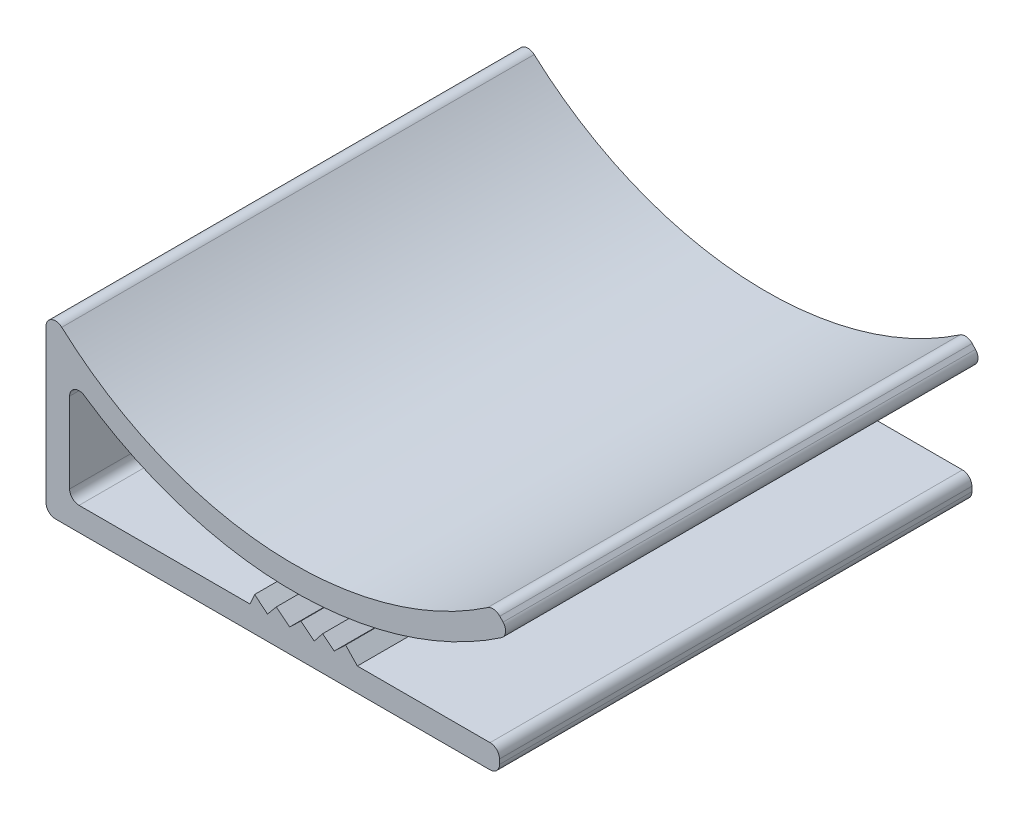
ISO-10303-21;
HEADER;
FILE_DESCRIPTION(('STEP AP214'),'2;1');
FILE_NAME('part.step','',(''),(''),'','','');
FILE_SCHEMA(('AUTOMOTIVE_DESIGN { 1 0 10303 214 1 1 1 1 }'));
ENDSEC;
DATA;
#1=APPLICATION_CONTEXT('core data for automotive mechanical design processes');
#2=APPLICATION_PROTOCOL_DEFINITION('international standard','automotive_design',2000,#1);
#3=PRODUCT_CONTEXT('',#1,'mechanical');
#4=PRODUCT('Part','Part','',(#3));
#5=PRODUCT_RELATED_PRODUCT_CATEGORY('part','',(#4));
#6=PRODUCT_DEFINITION_FORMATION('','',#4);
#7=PRODUCT_DEFINITION_CONTEXT('part definition',#1,'design');
#8=PRODUCT_DEFINITION('design','',#6,#7);
#9=PRODUCT_DEFINITION_SHAPE('','',#8);
#10=(LENGTH_UNIT() NAMED_UNIT(*) SI_UNIT(.MILLI.,.METRE.));
#11=(NAMED_UNIT(*) PLANE_ANGLE_UNIT() SI_UNIT($,.RADIAN.));
#12=(NAMED_UNIT(*) SI_UNIT($,.STERADIAN.) SOLID_ANGLE_UNIT());
#13=UNCERTAINTY_MEASURE_WITH_UNIT(LENGTH_MEASURE(1.E-05),#10,'distance_accuracy_value','');
#14=(GEOMETRIC_REPRESENTATION_CONTEXT(3) GLOBAL_UNCERTAINTY_ASSIGNED_CONTEXT((#13)) GLOBAL_UNIT_ASSIGNED_CONTEXT((#10,
#11,#12)) REPRESENTATION_CONTEXT('',''));
#15=CARTESIAN_POINT('',(0.,0.,0.));
#16=DIRECTION('',(0.,0.,1.));
#17=DIRECTION('',(1.,0.,0.));
#18=AXIS2_PLACEMENT_3D('',#15,#16,#17);
#19=CARTESIAN_POINT('',(23.5,0.75,25.));
#20=DIRECTION('',(0.,0.,-1.));
#21=DIRECTION('',(-1.,0.,0.));
#22=AXIS2_PLACEMENT_3D('',#19,#20,#21);
#23=CYLINDRICAL_SURFACE('',#22,0.5);
#24=CARTESIAN_POINT('',(23.5,0.75,0.));
#25=DIRECTION('',(0.,0.,1.));
#26=DIRECTION('',(-1.,0.,0.));
#27=AXIS2_PLACEMENT_3D('',#24,#25,#26);
#28=CIRCLE('',#27,0.5);
#29=CARTESIAN_POINT('',(24.,0.749999999999996,0.));
#30=VERTEX_POINT('',#29);
#31=CARTESIAN_POINT('',(23.5,1.25,0.));
#32=VERTEX_POINT('',#31);
#33=EDGE_CURVE('E242',#30,#32,#28,.T.);
#34=ORIENTED_EDGE('',*,*,#33,.T.);
#35=DIRECTION('',(0.,0.,-1.));
#36=VECTOR('',#35,1.);
#37=CARTESIAN_POINT('',(23.5,1.25,25.));
#38=LINE('',#37,#36);
#39=CARTESIAN_POINT('',(23.5,1.25,25.));
#40=VERTEX_POINT('',#39);
#41=EDGE_CURVE('E11',#40,#32,#38,.T.);
#42=ORIENTED_EDGE('',*,*,#41,.F.);
#43=CARTESIAN_POINT('',(23.5,0.75,25.));
#44=DIRECTION('',(0.,0.,1.));
#45=DIRECTION('',(-1.,0.,0.));
#46=AXIS2_PLACEMENT_3D('',#43,#44,#45);
#47=CIRCLE('',#46,0.5);
#48=CARTESIAN_POINT('',(24.,0.749999999999996,25.));
#49=VERTEX_POINT('',#48);
#50=EDGE_CURVE('E295',#49,#40,#47,.T.);
#51=ORIENTED_EDGE('',*,*,#50,.F.);
#52=DIRECTION('',(0.,0.,-1.));
#53=VECTOR('',#52,1.);
#54=CARTESIAN_POINT('',(24.,0.749999999999996,25.));
#55=LINE('',#54,#53);
#56=EDGE_CURVE('E238',#49,#30,#55,.T.);
#57=ORIENTED_EDGE('',*,*,#56,.T.);
#58=EDGE_LOOP('',(#34,#42,#51,#57));
#59=FACE_BOUND('',#58,.T.);
#60=ADVANCED_FACE('F32',(#59),#23,.T.);
#61=CARTESIAN_POINT('',(16.4778212901355,1.25,25.));
#62=DIRECTION('',(0.,-1.,0.));
#63=DIRECTION('',(1.,0.,0.));
#64=AXIS2_PLACEMENT_3D('',#61,#62,#63);
#65=PLANE('',#64);
#66=DIRECTION('',(-1.,0.,0.));
#67=VECTOR('',#66,1.);
#68=CARTESIAN_POINT('',(16.4778212901355,1.25,0.));
#69=LINE('',#68,#67);
#70=CARTESIAN_POINT('',(16.4778212901355,1.25,0.));
#71=VERTEX_POINT('',#70);
#72=EDGE_CURVE('E245',#32,#71,#69,.T.);
#73=ORIENTED_EDGE('',*,*,#72,.T.);
#74=DIRECTION('',(0.,0.,-1.));
#75=VECTOR('',#74,1.);
#76=CARTESIAN_POINT('',(16.4778212901355,1.25,25.));
#77=LINE('',#76,#75);
#78=CARTESIAN_POINT('',(16.4778212901355,1.25,25.));
#79=VERTEX_POINT('',#78);
#80=EDGE_CURVE('E40',#79,#71,#77,.T.);
#81=ORIENTED_EDGE('',*,*,#80,.F.);
#82=DIRECTION('',(-1.,0.,0.));
#83=VECTOR('',#82,1.);
#84=CARTESIAN_POINT('',(16.4778212901355,1.25,25.));
#85=LINE('',#84,#83);
#86=EDGE_CURVE('E148',#40,#79,#85,.T.);
#87=ORIENTED_EDGE('',*,*,#86,.F.);
#88=ORIENTED_EDGE('',*,*,#41,.T.);
#89=EDGE_LOOP('',(#73,#81,#87,#88));
#90=FACE_BOUND('',#89,.T.);
#91=ADVANCED_FACE('F448',(#90),#65,.F.);
#92=CARTESIAN_POINT('',(15.8563134752214,1.90007682186103,25.));
#93=DIRECTION('',(-0.722811118080419,-0.691045647970766,0.));
#94=DIRECTION('',(0.691045647970766,-0.722811118080419,0.));
#95=AXIS2_PLACEMENT_3D('',#92,#93,#94);
#96=PLANE('',#95);
#97=DIRECTION('',(-0.691045647970766,0.722811118080419,0.));
#98=VECTOR('',#97,1.);
#99=CARTESIAN_POINT('',(15.8563134752214,1.90007682186103,0.));
#100=LINE('',#99,#98);
#101=CARTESIAN_POINT('',(15.8563134752214,1.90007682186103,0.));
#102=VERTEX_POINT('',#101);
#103=EDGE_CURVE('E247',#71,#102,#100,.T.);
#104=ORIENTED_EDGE('',*,*,#103,.T.);
#105=DIRECTION('',(0.,0.,-1.));
#106=VECTOR('',#105,1.);
#107=CARTESIAN_POINT('',(15.8563134752214,1.90007682186103,25.));
#108=LINE('',#107,#106);
#109=CARTESIAN_POINT('',(15.8563134752214,1.90007682186103,25.));
#110=VERTEX_POINT('',#109);
#111=EDGE_CURVE('E359',#110,#102,#108,.T.);
#112=ORIENTED_EDGE('',*,*,#111,.F.);
#113=DIRECTION('',(-0.691045647970766,0.722811118080419,0.));
#114=VECTOR('',#113,1.);
#115=CARTESIAN_POINT('',(15.8563134752214,1.90007682186103,25.));
#116=LINE('',#115,#114);
#117=EDGE_CURVE('E367',#79,#110,#116,.T.);
#118=ORIENTED_EDGE('',*,*,#117,.F.);
#119=ORIENTED_EDGE('',*,*,#80,.T.);
#120=EDGE_LOOP('',(#104,#112,#118,#119));
#121=FACE_BOUND('',#120,.T.);
#122=ADVANCED_FACE('F365',(#121),#96,.F.);
#123=CARTESIAN_POINT('',(15.2551485660949,1.32533138176891,25.));
#124=DIRECTION('',(0.691045647970767,-0.722811118080418,0.));
#125=DIRECTION('',(0.722811118080418,0.691045647970767,0.));
#126=AXIS2_PLACEMENT_3D('',#123,#124,#125);
#127=PLANE('',#126);
#128=DIRECTION('',(-0.722811118080418,-0.691045647970766,0.));
#129=VECTOR('',#128,1.);
#130=CARTESIAN_POINT('',(15.2551485660949,1.32533138176891,0.));
#131=LINE('',#130,#129);
#132=CARTESIAN_POINT('',(15.2551485660949,1.32533138176891,0.));
#133=VERTEX_POINT('',#132);
#134=EDGE_CURVE('E249',#102,#133,#131,.T.);
#135=ORIENTED_EDGE('',*,*,#134,.T.);
#136=DIRECTION('',(0.,0.,-1.));
#137=VECTOR('',#136,1.);
#138=CARTESIAN_POINT('',(15.2551485660949,1.32533138176891,25.));
#139=LINE('',#138,#137);
#140=CARTESIAN_POINT('',(15.2551485660949,1.32533138176891,25.));
#141=VERTEX_POINT('',#140);
#142=EDGE_CURVE('E356',#141,#133,#139,.T.);
#143=ORIENTED_EDGE('',*,*,#142,.F.);
#144=DIRECTION('',(-0.722811118080418,-0.691045647970766,0.));
#145=VECTOR('',#144,1.);
#146=CARTESIAN_POINT('',(15.2551485660949,1.32533138176891,25.));
#147=LINE('',#146,#145);
#148=EDGE_CURVE('E385',#110,#141,#147,.T.);
#149=ORIENTED_EDGE('',*,*,#148,.F.);
#150=ORIENTED_EDGE('',*,*,#111,.T.);
#151=EDGE_LOOP('',(#135,#143,#149,#150));
#152=FACE_BOUND('',#151,.T.);
#153=ADVANCED_FACE('F376',(#152),#127,.F.);
#154=CARTESIAN_POINT('',(14.6403505441033,1.81230300599921,25.));
#155=DIRECTION('',(-0.620903986336339,-0.783886624296934,0.));
#156=DIRECTION('',(0.783886624296934,-0.620903986336339,0.));
#157=AXIS2_PLACEMENT_3D('',#154,#155,#156);
#158=PLANE('',#157);
#159=DIRECTION('',(-0.783886624296934,0.620903986336339,0.));
#160=VECTOR('',#159,1.);
#161=CARTESIAN_POINT('',(14.6403505441033,1.81230300599921,0.));
#162=LINE('',#161,#160);
#163=CARTESIAN_POINT('',(14.6403505441033,1.81230300599921,0.));
#164=VERTEX_POINT('',#163);
#165=EDGE_CURVE('E251',#133,#164,#162,.T.);
#166=ORIENTED_EDGE('',*,*,#165,.T.);
#167=DIRECTION('',(0.,0.,-1.));
#168=VECTOR('',#167,1.);
#169=CARTESIAN_POINT('',(14.6403505441033,1.81230300599921,25.));
#170=LINE('',#169,#168);
#171=CARTESIAN_POINT('',(14.6403505441033,1.81230300599921,25.));
#172=VERTEX_POINT('',#171);
#173=EDGE_CURVE('E353',#172,#164,#170,.T.);
#174=ORIENTED_EDGE('',*,*,#173,.F.);
#175=DIRECTION('',(-0.783886624296934,0.620903986336339,0.));
#176=VECTOR('',#175,1.);
#177=CARTESIAN_POINT('',(14.6403505441033,1.81230300599921,25.));
#178=LINE('',#177,#176);
#179=EDGE_CURVE('E382',#141,#172,#178,.T.);
#180=ORIENTED_EDGE('',*,*,#179,.F.);
#181=ORIENTED_EDGE('',*,*,#142,.T.);
#182=EDGE_LOOP('',(#166,#174,#180,#181));
#183=FACE_BOUND('',#182,.T.);
#184=ADVANCED_FACE('F380',(#183),#158,.F.);
#185=CARTESIAN_POINT('',(14.1949593776614,1.25,25.));
#186=DIRECTION('',(0.783886624296934,-0.62090398633634,0.));
#187=DIRECTION('',(0.62090398633634,0.783886624296934,0.));
#188=AXIS2_PLACEMENT_3D('',#185,#186,#187);
#189=PLANE('',#188);
#190=DIRECTION('',(-0.62090398633634,-0.783886624296934,0.));
#191=VECTOR('',#190,1.);
#192=CARTESIAN_POINT('',(14.1949593776614,1.25,0.));
#193=LINE('',#192,#191);
#194=CARTESIAN_POINT('',(14.1949593776614,1.25,0.));
#195=VERTEX_POINT('',#194);
#196=EDGE_CURVE('E253',#164,#195,#193,.T.);
#197=ORIENTED_EDGE('',*,*,#196,.T.);
#198=DIRECTION('',(0.,0.,-1.));
#199=VECTOR('',#198,1.);
#200=CARTESIAN_POINT('',(14.1949593776614,1.25,25.));
#201=LINE('',#200,#199);
#202=CARTESIAN_POINT('',(14.1949593776614,1.25,25.));
#203=VERTEX_POINT('',#202);
#204=EDGE_CURVE('E350',#203,#195,#201,.T.);
#205=ORIENTED_EDGE('',*,*,#204,.F.);
#206=DIRECTION('',(-0.62090398633634,-0.783886624296934,0.));
#207=VECTOR('',#206,1.);
#208=CARTESIAN_POINT('',(14.1949593776614,1.25,25.));
#209=LINE('',#208,#207);
#210=EDGE_CURVE('E384',#172,#203,#209,.T.);
#211=ORIENTED_EDGE('',*,*,#210,.F.);
#212=ORIENTED_EDGE('',*,*,#173,.T.);
#213=EDGE_LOOP('',(#197,#205,#211,#212));
#214=FACE_BOUND('',#213,.T.);
#215=ADVANCED_FACE('F461',(#214),#189,.F.);
#216=CARTESIAN_POINT('',(13.4850560513749,1.81230300599921,25.));
#217=DIRECTION('',(-0.620903986336339,-0.783886624296934,0.));
#218=DIRECTION('',(0.783886624296934,-0.620903986336339,0.));
#219=AXIS2_PLACEMENT_3D('',#216,#217,#218);
#220=PLANE('',#219);
#221=DIRECTION('',(-0.783886624296934,0.620903986336339,0.));
#222=VECTOR('',#221,1.);
#223=CARTESIAN_POINT('',(13.4850560513749,1.81230300599921,0.));
#224=LINE('',#223,#222);
#225=CARTESIAN_POINT('',(13.4850560513749,1.81230300599921,0.));
#226=VERTEX_POINT('',#225);
#227=EDGE_CURVE('E255',#195,#226,#224,.T.);
#228=ORIENTED_EDGE('',*,*,#227,.T.);
#229=DIRECTION('',(0.,0.,-1.));
#230=VECTOR('',#229,1.);
#231=CARTESIAN_POINT('',(13.4850560513749,1.81230300599921,25.));
#232=LINE('',#231,#230);
#233=CARTESIAN_POINT('',(13.4850560513749,1.81230300599921,25.));
#234=VERTEX_POINT('',#233);
#235=EDGE_CURVE('E347',#234,#226,#232,.T.);
#236=ORIENTED_EDGE('',*,*,#235,.F.);
#237=DIRECTION('',(-0.783886624296934,0.620903986336339,0.));
#238=VECTOR('',#237,1.);
#239=CARTESIAN_POINT('',(13.4850560513749,1.81230300599921,25.));
#240=LINE('',#239,#238);
#241=EDGE_CURVE('E387',#203,#234,#240,.T.);
#242=ORIENTED_EDGE('',*,*,#241,.F.);
#243=ORIENTED_EDGE('',*,*,#204,.T.);
#244=EDGE_LOOP('',(#228,#236,#242,#243));
#245=FACE_BOUND('',#244,.T.);
#246=ADVANCED_FACE('F464',(#245),#220,.F.);
#247=CARTESIAN_POINT('',(12.8969055208567,1.25,25.));
#248=DIRECTION('',(0.691045647970767,-0.722811118080418,0.));
#249=DIRECTION('',(0.722811118080418,0.691045647970767,0.));
#250=AXIS2_PLACEMENT_3D('',#247,#248,#249);
#251=PLANE('',#250);
#252=DIRECTION('',(-0.722811118080418,-0.691045647970766,0.));
#253=VECTOR('',#252,1.);
#254=CARTESIAN_POINT('',(12.8969055208567,1.25,0.));
#255=LINE('',#254,#253);
#256=CARTESIAN_POINT('',(12.8969055208567,1.25,0.));
#257=VERTEX_POINT('',#256);
#258=EDGE_CURVE('E257',#226,#257,#255,.T.);
#259=ORIENTED_EDGE('',*,*,#258,.T.);
#260=DIRECTION('',(0.,0.,-1.));
#261=VECTOR('',#260,1.);
#262=CARTESIAN_POINT('',(12.8969055208567,1.25,25.));
#263=LINE('',#262,#261);
#264=CARTESIAN_POINT('',(12.8969055208567,1.25,25.));
#265=VERTEX_POINT('',#264);
#266=EDGE_CURVE('E344',#265,#257,#263,.T.);
#267=ORIENTED_EDGE('',*,*,#266,.F.);
#268=DIRECTION('',(-0.722811118080418,-0.691045647970766,0.));
#269=VECTOR('',#268,1.);
#270=CARTESIAN_POINT('',(12.8969055208567,1.25,25.));
#271=LINE('',#270,#269);
#272=EDGE_CURVE('E393',#234,#265,#271,.T.);
#273=ORIENTED_EDGE('',*,*,#272,.F.);
#274=ORIENTED_EDGE('',*,*,#235,.T.);
#275=EDGE_LOOP('',(#259,#267,#273,#274));
#276=FACE_BOUND('',#275,.T.);
#277=ADVANCED_FACE('F468',(#276),#251,.F.);
#278=CARTESIAN_POINT('',(12.1870021945702,1.81230300599921,25.));
#279=DIRECTION('',(-0.62090398633634,-0.783886624296934,0.));
#280=DIRECTION('',(0.783886624296934,-0.62090398633634,0.));
#281=AXIS2_PLACEMENT_3D('',#278,#279,#280);
#282=PLANE('',#281);
#283=DIRECTION('',(-0.783886624296934,0.62090398633634,0.));
#284=VECTOR('',#283,1.);
#285=CARTESIAN_POINT('',(12.1870021945702,1.81230300599921,0.));
#286=LINE('',#285,#284);
#287=CARTESIAN_POINT('',(12.1870021945702,1.81230300599921,0.));
#288=VERTEX_POINT('',#287);
#289=EDGE_CURVE('E259',#257,#288,#286,.T.);
#290=ORIENTED_EDGE('',*,*,#289,.T.);
#291=DIRECTION('',(0.,0.,-1.));
#292=VECTOR('',#291,1.);
#293=CARTESIAN_POINT('',(12.1870021945702,1.81230300599921,25.));
#294=LINE('',#293,#292);
#295=CARTESIAN_POINT('',(12.1870021945702,1.81230300599921,25.));
#296=VERTEX_POINT('',#295);
#297=EDGE_CURVE('E341',#296,#288,#294,.T.);
#298=ORIENTED_EDGE('',*,*,#297,.F.);
#299=DIRECTION('',(-0.783886624296934,0.62090398633634,0.));
#300=VECTOR('',#299,1.);
#301=CARTESIAN_POINT('',(12.1870021945702,1.81230300599921,25.));
#302=LINE('',#301,#300);
#303=EDGE_CURVE('E395',#265,#296,#302,.T.);
#304=ORIENTED_EDGE('',*,*,#303,.F.);
#305=ORIENTED_EDGE('',*,*,#266,.T.);
#306=EDGE_LOOP('',(#290,#298,#304,#305));
#307=FACE_BOUND('',#306,.T.);
#308=ADVANCED_FACE('F472',(#307),#282,.F.);
#309=CARTESIAN_POINT('',(11.7206044598204,1.25,25.));
#310=DIRECTION('',(0.769692257095029,-0.638415091745143,0.));
#311=DIRECTION('',(0.638415091745143,0.769692257095029,0.));
#312=AXIS2_PLACEMENT_3D('',#309,#310,#311);
#313=PLANE('',#312);
#314=DIRECTION('',(-0.638415091745143,-0.769692257095029,0.));
#315=VECTOR('',#314,1.);
#316=CARTESIAN_POINT('',(11.7206044598204,1.25,0.));
#317=LINE('',#316,#315);
#318=CARTESIAN_POINT('',(11.7206044598204,1.25,0.));
#319=VERTEX_POINT('',#318);
#320=EDGE_CURVE('E261',#288,#319,#317,.T.);
#321=ORIENTED_EDGE('',*,*,#320,.T.);
#322=DIRECTION('',(0.,0.,-1.));
#323=VECTOR('',#322,1.);
#324=CARTESIAN_POINT('',(11.7206044598204,1.25,25.));
#325=LINE('',#324,#323);
#326=CARTESIAN_POINT('',(11.7206044598204,1.25,25.));
#327=VERTEX_POINT('',#326);
#328=EDGE_CURVE('E338',#327,#319,#325,.T.);
#329=ORIENTED_EDGE('',*,*,#328,.F.);
#330=DIRECTION('',(-0.638415091745143,-0.769692257095029,0.));
#331=VECTOR('',#330,1.);
#332=CARTESIAN_POINT('',(11.7206044598204,1.25,25.));
#333=LINE('',#332,#331);
#334=EDGE_CURVE('E397',#296,#327,#333,.T.);
#335=ORIENTED_EDGE('',*,*,#334,.F.);
#336=ORIENTED_EDGE('',*,*,#297,.T.);
#337=EDGE_LOOP('',(#321,#329,#335,#336));
#338=FACE_BOUND('',#337,.T.);
#339=ADVANCED_FACE('F476',(#338),#313,.F.);
#340=CARTESIAN_POINT('',(11.0426752011687,1.81230300599921,25.));
#341=DIRECTION('',(-0.638415091745142,-0.76969225709503,0.));
#342=DIRECTION('',(0.76969225709503,-0.638415091745142,0.));
#343=AXIS2_PLACEMENT_3D('',#340,#341,#342);
#344=PLANE('',#343);
#345=DIRECTION('',(-0.76969225709503,0.638415091745142,0.));
#346=VECTOR('',#345,1.);
#347=CARTESIAN_POINT('',(11.0426752011687,1.81230300599921,0.));
#348=LINE('',#347,#346);
#349=CARTESIAN_POINT('',(11.0426752011687,1.81230300599921,0.));
#350=VERTEX_POINT('',#349);
#351=EDGE_CURVE('E263',#319,#350,#348,.T.);
#352=ORIENTED_EDGE('',*,*,#351,.T.);
#353=DIRECTION('',(0.,0.,-1.));
#354=VECTOR('',#353,1.);
#355=CARTESIAN_POINT('',(11.0426752011687,1.81230300599921,25.));
#356=LINE('',#355,#354);
#357=CARTESIAN_POINT('',(11.0426752011687,1.81230300599921,25.));
#358=VERTEX_POINT('',#357);
#359=EDGE_CURVE('E335',#358,#350,#356,.T.);
#360=ORIENTED_EDGE('',*,*,#359,.F.);
#361=DIRECTION('',(-0.76969225709503,0.638415091745142,0.));
#362=VECTOR('',#361,1.);
#363=CARTESIAN_POINT('',(11.0426752011687,1.81230300599921,25.));
#364=LINE('',#363,#362);
#365=EDGE_CURVE('E399',#327,#358,#364,.T.);
#366=ORIENTED_EDGE('',*,*,#365,.F.);
#367=ORIENTED_EDGE('',*,*,#328,.T.);
#368=EDGE_LOOP('',(#352,#360,#366,#367));
#369=FACE_BOUND('',#368,.T.);
#370=ADVANCED_FACE('F480',(#369),#344,.F.);
#371=CARTESIAN_POINT('',(10.7979933015806,1.25,25.));
#372=DIRECTION('',(0.916949367361467,-0.399003581055865,0.));
#373=DIRECTION('',(0.399003581055865,0.916949367361467,0.));
#374=AXIS2_PLACEMENT_3D('',#371,#372,#373);
#375=PLANE('',#374);
#376=DIRECTION('',(-0.399003581055865,-0.916949367361467,0.));
#377=VECTOR('',#376,1.);
#378=CARTESIAN_POINT('',(10.7979933015806,1.25,0.));
#379=LINE('',#378,#377);
#380=CARTESIAN_POINT('',(10.7979933015806,1.25,0.));
#381=VERTEX_POINT('',#380);
#382=EDGE_CURVE('E265',#350,#381,#379,.T.);
#383=ORIENTED_EDGE('',*,*,#382,.T.);
#384=DIRECTION('',(0.,0.,-1.));
#385=VECTOR('',#384,1.);
#386=CARTESIAN_POINT('',(10.7979933015806,1.25,25.));
#387=LINE('',#386,#385);
#388=CARTESIAN_POINT('',(10.7979933015806,1.25,25.));
#389=VERTEX_POINT('',#388);
#390=EDGE_CURVE('E332',#389,#381,#387,.T.);
#391=ORIENTED_EDGE('',*,*,#390,.F.);
#392=DIRECTION('',(-0.399003581055865,-0.916949367361467,0.));
#393=VECTOR('',#392,1.);
#394=CARTESIAN_POINT('',(10.7979933015806,1.25,25.));
#395=LINE('',#394,#393);
#396=EDGE_CURVE('E401',#358,#389,#395,.T.);
#397=ORIENTED_EDGE('',*,*,#396,.F.);
#398=ORIENTED_EDGE('',*,*,#359,.T.);
#399=EDGE_LOOP('',(#383,#391,#397,#398));
#400=FACE_BOUND('',#399,.T.);
#401=ADVANCED_FACE('F484',(#400),#375,.F.);
#402=CARTESIAN_POINT('',(1.75,1.25,25.));
#403=DIRECTION('',(0.,-1.,0.));
#404=DIRECTION('',(0.,0.,-1.));
#405=AXIS2_PLACEMENT_3D('',#402,#403,#404);
#406=PLANE('',#405);
#407=DIRECTION('',(-1.,0.,0.));
#408=VECTOR('',#407,1.);
#409=CARTESIAN_POINT('',(1.75,1.25,0.));
#410=LINE('',#409,#408);
#411=CARTESIAN_POINT('',(1.75,1.25,0.));
#412=VERTEX_POINT('',#411);
#413=EDGE_CURVE('E267',#381,#412,#410,.T.);
#414=ORIENTED_EDGE('',*,*,#413,.T.);
#415=DIRECTION('',(0.,0.,-1.));
#416=VECTOR('',#415,1.);
#417=CARTESIAN_POINT('',(1.75,1.25,25.));
#418=LINE('',#417,#416);
#419=CARTESIAN_POINT('',(1.75,1.25,25.));
#420=VERTEX_POINT('',#419);
#421=EDGE_CURVE('E329',#420,#412,#418,.T.);
#422=ORIENTED_EDGE('',*,*,#421,.F.);
#423=DIRECTION('',(-1.,0.,0.));
#424=VECTOR('',#423,1.);
#425=CARTESIAN_POINT('',(1.75,1.25,25.));
#426=LINE('',#425,#424);
#427=EDGE_CURVE('E403',#389,#420,#426,.T.);
#428=ORIENTED_EDGE('',*,*,#427,.F.);
#429=ORIENTED_EDGE('',*,*,#390,.T.);
#430=EDGE_LOOP('',(#414,#422,#428,#429));
#431=FACE_BOUND('',#430,.T.);
#432=ADVANCED_FACE('F488',(#431),#406,.F.);
#433=CARTESIAN_POINT('',(1.75,1.75,25.));
#434=DIRECTION('',(0.,0.,-1.));
#435=DIRECTION('',(-1.,0.,0.));
#436=AXIS2_PLACEMENT_3D('',#433,#434,#435);
#437=CYLINDRICAL_SURFACE('',#436,0.5);
#438=CARTESIAN_POINT('',(1.75,1.75,0.));
#439=DIRECTION('',(0.,0.,-1.));
#440=DIRECTION('',(-1.,0.,0.));
#441=AXIS2_PLACEMENT_3D('',#438,#439,#440);
#442=CIRCLE('',#441,0.5);
#443=CARTESIAN_POINT('',(1.25,1.75,0.));
#444=VERTEX_POINT('',#443);
#445=EDGE_CURVE('E269',#412,#444,#442,.T.);
#446=ORIENTED_EDGE('',*,*,#445,.T.);
#447=DIRECTION('',(0.,0.,-1.));
#448=VECTOR('',#447,1.);
#449=CARTESIAN_POINT('',(1.25,1.75,25.));
#450=LINE('',#449,#448);
#451=CARTESIAN_POINT('',(1.25,1.75,25.));
#452=VERTEX_POINT('',#451);
#453=EDGE_CURVE('E326',#452,#444,#450,.T.);
#454=ORIENTED_EDGE('',*,*,#453,.F.);
#455=CARTESIAN_POINT('',(1.75,1.75,25.));
#456=DIRECTION('',(0.,0.,-1.));
#457=DIRECTION('',(-1.,0.,0.));
#458=AXIS2_PLACEMENT_3D('',#455,#456,#457);
#459=CIRCLE('',#458,0.5);
#460=EDGE_CURVE('E405',#420,#452,#459,.T.);
#461=ORIENTED_EDGE('',*,*,#460,.F.);
#462=ORIENTED_EDGE('',*,*,#421,.T.);
#463=EDGE_LOOP('',(#446,#454,#461,#462));
#464=FACE_BOUND('',#463,.T.);
#465=ADVANCED_FACE('F492',(#464),#437,.F.);
#466=CARTESIAN_POINT('',(1.25,1.75,25.));
#467=DIRECTION('',(-1.,0.,0.));
#468=DIRECTION('',(0.,-1.,0.));
#469=AXIS2_PLACEMENT_3D('',#466,#467,#468);
#470=PLANE('',#469);
#471=DIRECTION('',(0.,1.,0.));
#472=VECTOR('',#471,1.);
#473=CARTESIAN_POINT('',(1.25,1.75,0.));
#474=LINE('',#473,#472);
#475=CARTESIAN_POINT('',(1.25,6.00493443319065,0.));
#476=VERTEX_POINT('',#475);
#477=EDGE_CURVE('E271',#444,#476,#474,.T.);
#478=ORIENTED_EDGE('',*,*,#477,.T.);
#479=DIRECTION('',(0.,0.,-1.));
#480=VECTOR('',#479,1.);
#481=CARTESIAN_POINT('',(1.25,6.00493443319065,25.));
#482=LINE('',#481,#480);
#483=CARTESIAN_POINT('',(1.25,6.00493443319065,25.));
#484=VERTEX_POINT('',#483);
#485=EDGE_CURVE('E323',#484,#476,#482,.T.);
#486=ORIENTED_EDGE('',*,*,#485,.F.);
#487=DIRECTION('',(0.,1.,0.));
#488=VECTOR('',#487,1.);
#489=CARTESIAN_POINT('',(1.25,1.75,25.));
#490=LINE('',#489,#488);
#491=EDGE_CURVE('E407',#452,#484,#490,.T.);
#492=ORIENTED_EDGE('',*,*,#491,.F.);
#493=ORIENTED_EDGE('',*,*,#453,.T.);
#494=EDGE_LOOP('',(#478,#486,#492,#493));
#495=FACE_BOUND('',#494,.T.);
#496=ADVANCED_FACE('F496',(#495),#470,.F.);
#497=CARTESIAN_POINT('',(1.75000000000001,6.00493443319065,25.));
#498=DIRECTION('',(0.,0.,-1.));
#499=DIRECTION('',(-1.,0.,0.));
#500=AXIS2_PLACEMENT_3D('',#497,#498,#499);
#501=CYLINDRICAL_SURFACE('',#500,0.500000000000003);
#502=CARTESIAN_POINT('',(1.75000000000001,6.00493443319065,0.));
#503=DIRECTION('',(0.,0.,-1.));
#504=DIRECTION('',(-1.,0.,0.));
#505=AXIS2_PLACEMENT_3D('',#502,#503,#504);
#506=CIRCLE('',#505,0.500000000000003);
#507=CARTESIAN_POINT('',(2.03310243748513,6.41706670551349,0.));
#508=VERTEX_POINT('',#507);
#509=EDGE_CURVE('E273',#476,#508,#506,.T.);
#510=ORIENTED_EDGE('',*,*,#509,.T.);
#511=DIRECTION('',(0.,0.,-1.));
#512=VECTOR('',#511,1.);
#513=CARTESIAN_POINT('',(2.03310243748513,6.41706670551349,25.));
#514=LINE('',#513,#512);
#515=CARTESIAN_POINT('',(2.03310243748513,6.41706670551349,25.));
#516=VERTEX_POINT('',#515);
#517=EDGE_CURVE('E320',#516,#508,#514,.T.);
#518=ORIENTED_EDGE('',*,*,#517,.F.);
#519=CARTESIAN_POINT('',(1.75000000000001,6.00493443319065,25.));
#520=DIRECTION('',(0.,0.,-1.));
#521=DIRECTION('',(-1.,0.,0.));
#522=AXIS2_PLACEMENT_3D('',#519,#520,#521);
#523=CIRCLE('',#522,0.500000000000003);
#524=EDGE_CURVE('E409',#484,#516,#523,.T.);
#525=ORIENTED_EDGE('',*,*,#524,.F.);
#526=ORIENTED_EDGE('',*,*,#485,.T.);
#527=EDGE_LOOP('',(#510,#518,#525,#526));
#528=FACE_BOUND('',#527,.T.);
#529=ADVANCED_FACE('F500',(#528),#501,.F.);
#530=CARTESIAN_POINT('',(13.1087656750016,22.5406942451033,25.));
#531=DIRECTION('',(0.,0.,-1.));
#532=DIRECTION('',(-1.,0.,0.));
#533=AXIS2_PLACEMENT_3D('',#530,#531,#532);
#534=CYLINDRICAL_SURFACE('',#533,19.5612290305669);
#535=CARTESIAN_POINT('',(13.1087656750016,22.5406942451033,0.));
#536=DIRECTION('',(0.,0.,1.));
#537=DIRECTION('',(1.,0.,0.));
#538=AXIS2_PLACEMENT_3D('',#535,#536,#537);
#539=CIRCLE('',#538,19.5612290305669);
#540=CARTESIAN_POINT('',(24.1038233436273,6.36199256512025,0.));
#541=VERTEX_POINT('',#540);
#542=EDGE_CURVE('E276',#508,#541,#539,.T.);
#543=ORIENTED_EDGE('',*,*,#542,.T.);
#544=DIRECTION('',(0.,0.,-1.));
#545=VECTOR('',#544,1.);
#546=CARTESIAN_POINT('',(24.1038233436273,6.36199256512025,25.));
#547=LINE('',#546,#545);
#548=CARTESIAN_POINT('',(24.1038233436273,6.36199256512025,25.));
#549=VERTEX_POINT('',#548);
#550=EDGE_CURVE('E317',#549,#541,#547,.T.);
#551=ORIENTED_EDGE('',*,*,#550,.F.);
#552=CARTESIAN_POINT('',(13.1087656750016,22.5406942451033,25.));
#553=DIRECTION('',(0.,0.,1.));
#554=DIRECTION('',(1.,0.,0.));
#555=AXIS2_PLACEMENT_3D('',#552,#553,#554);
#556=CIRCLE('',#555,19.5612290305669);
#557=EDGE_CURVE('E411',#516,#549,#556,.T.);
#558=ORIENTED_EDGE('',*,*,#557,.F.);
#559=ORIENTED_EDGE('',*,*,#517,.T.);
#560=EDGE_LOOP('',(#543,#551,#558,#559));
#561=FACE_BOUND('',#560,.T.);
#562=ADVANCED_FACE('F504',(#561),#534,.T.);
#563=CARTESIAN_POINT('',(23.8227812462355,6.77553257466418,25.));
#564=DIRECTION('',(0.,0.,-1.));
#565=DIRECTION('',(-1.,0.,0.));
#566=AXIS2_PLACEMENT_3D('',#563,#564,#565);
#567=CYLINDRICAL_SURFACE('',#566,0.499999999999999);
#568=CARTESIAN_POINT('',(23.8227812462355,6.77553257466418,0.));
#569=DIRECTION('',(0.,0.,1.));
#570=DIRECTION('',(1.,0.,0.));
#571=AXIS2_PLACEMENT_3D('',#568,#569,#570);
#572=CIRCLE('',#571,0.499999999999999);
#573=CARTESIAN_POINT('',(24.1885050706069,7.11648137476051,0.));
#574=VERTEX_POINT('',#573);
#575=EDGE_CURVE('E278',#541,#574,#572,.T.);
#576=ORIENTED_EDGE('',*,*,#575,.T.);
#577=DIRECTION('',(0.,0.,-1.));
#578=VECTOR('',#577,1.);
#579=CARTESIAN_POINT('',(24.1885050706069,7.11648137476051,25.));
#580=LINE('',#579,#578);
#581=CARTESIAN_POINT('',(24.1885050706069,7.11648137476051,25.));
#582=VERTEX_POINT('',#581);
#583=EDGE_CURVE('E314',#582,#574,#580,.T.);
#584=ORIENTED_EDGE('',*,*,#583,.F.);
#585=CARTESIAN_POINT('',(23.8227812462355,6.77553257466418,25.));
#586=DIRECTION('',(0.,0.,1.));
#587=DIRECTION('',(1.,0.,0.));
#588=AXIS2_PLACEMENT_3D('',#585,#586,#587);
#589=CIRCLE('',#588,0.499999999999999);
#590=EDGE_CURVE('E413',#549,#582,#589,.T.);
#591=ORIENTED_EDGE('',*,*,#590,.F.);
#592=ORIENTED_EDGE('',*,*,#550,.T.);
#593=EDGE_LOOP('',(#576,#584,#591,#592));
#594=FACE_BOUND('',#593,.T.);
#595=ADVANCED_FACE('F508',(#594),#567,.T.);
#596=CARTESIAN_POINT('',(24.1885050706069,7.11648137476051,25.));
#597=DIRECTION('',(-0.731447648742869,-0.681897600192675,0.));
#598=DIRECTION('',(0.681897600192675,-0.731447648742869,0.));
#599=AXIS2_PLACEMENT_3D('',#596,#597,#598);
#600=PLANE('',#599);
#601=DIRECTION('',(-0.681897600192675,0.731447648742869,0.));
#602=VECTOR('',#601,1.);
#603=CARTESIAN_POINT('',(24.1885050706069,7.11648137476051,0.));
#604=LINE('',#603,#602);
#605=CARTESIAN_POINT('',(24.0159762811018,7.30154695849083,0.));
#606=VERTEX_POINT('',#605);
#607=EDGE_CURVE('E280',#574,#606,#604,.T.);
#608=ORIENTED_EDGE('',*,*,#607,.T.);
#609=DIRECTION('',(0.,0.,-1.));
#610=VECTOR('',#609,1.);
#611=CARTESIAN_POINT('',(24.0159762811018,7.30154695849083,25.));
#612=LINE('',#611,#610);
#613=CARTESIAN_POINT('',(24.0159762811018,7.30154695849083,25.));
#614=VERTEX_POINT('',#613);
#615=EDGE_CURVE('E311',#614,#606,#612,.T.);
#616=ORIENTED_EDGE('',*,*,#615,.F.);
#617=DIRECTION('',(-0.681897600192675,0.731447648742869,0.));
#618=VECTOR('',#617,1.);
#619=CARTESIAN_POINT('',(24.1885050706069,7.11648137476051,25.));
#620=LINE('',#619,#618);
#621=EDGE_CURVE('E415',#582,#614,#620,.T.);
#622=ORIENTED_EDGE('',*,*,#621,.F.);
#623=ORIENTED_EDGE('',*,*,#583,.T.);
#624=EDGE_LOOP('',(#608,#616,#622,#623));
#625=FACE_BOUND('',#624,.T.);
#626=ADVANCED_FACE('F512',(#625),#600,.F.);
#627=CARTESIAN_POINT('',(23.6502524567304,6.9605981583945,25.));
#628=DIRECTION('',(0.,0.,-1.));
#629=DIRECTION('',(-1.,0.,0.));
#630=AXIS2_PLACEMENT_3D('',#627,#628,#629);
#631=CYLINDRICAL_SURFACE('',#630,0.499999999999998);
#632=CARTESIAN_POINT('',(23.6502524567304,6.9605981583945,0.));
#633=DIRECTION('',(0.,0.,1.));
#634=DIRECTION('',(-1.,0.,0.));
#635=AXIS2_PLACEMENT_3D('',#632,#633,#634);
#636=CIRCLE('',#635,0.499999999999998);
#637=CARTESIAN_POINT('',(23.3700611208905,7.37471506860255,0.));
#638=VERTEX_POINT('',#637);
#639=EDGE_CURVE('E282',#606,#638,#636,.T.);
#640=ORIENTED_EDGE('',*,*,#639,.T.);
#641=DIRECTION('',(0.,0.,-1.));
#642=VECTOR('',#641,1.);
#643=CARTESIAN_POINT('',(23.3700611208905,7.37471506860255,25.));
#644=LINE('',#643,#642);
#645=CARTESIAN_POINT('',(23.3700611208905,7.37471506860255,25.));
#646=VERTEX_POINT('',#645);
#647=EDGE_CURVE('E308',#646,#638,#644,.T.);
#648=ORIENTED_EDGE('',*,*,#647,.F.);
#649=CARTESIAN_POINT('',(23.6502524567304,6.9605981583945,25.));
#650=DIRECTION('',(0.,0.,1.));
#651=DIRECTION('',(-1.,0.,0.));
#652=AXIS2_PLACEMENT_3D('',#649,#650,#651);
#653=CIRCLE('',#652,0.499999999999998);
#654=EDGE_CURVE('E417',#614,#646,#653,.T.);
#655=ORIENTED_EDGE('',*,*,#654,.F.);
#656=ORIENTED_EDGE('',*,*,#615,.T.);
#657=EDGE_LOOP('',(#640,#648,#655,#656));
#658=FACE_BOUND('',#657,.T.);
#659=ADVANCED_FACE('F516',(#658),#631,.T.);
#660=CARTESIAN_POINT('',(13.1087656750016,22.5406942451033,25.));
#661=DIRECTION('',(0.,0.,-1.));
#662=DIRECTION('',(-1.,0.,0.));
#663=AXIS2_PLACEMENT_3D('',#660,#661,#662);
#664=CYLINDRICAL_SURFACE('',#663,18.3112290305669);
#665=CARTESIAN_POINT('',(13.1087656750016,22.5406942451033,0.));
#666=DIRECTION('',(0.,0.,-1.));
#667=DIRECTION('',(1.,0.,0.));
#668=AXIS2_PLACEMENT_3D('',#665,#666,#667);
#669=CIRCLE('',#668,18.3112290305669);
#670=CARTESIAN_POINT('',(0.835139337640123,8.95175737937674,0.));
#671=VERTEX_POINT('',#670);
#672=EDGE_CURVE('E284',#638,#671,#669,.T.);
#673=ORIENTED_EDGE('',*,*,#672,.T.);
#674=DIRECTION('',(0.,0.,-1.));
#675=VECTOR('',#674,1.);
#676=CARTESIAN_POINT('',(0.835139337640123,8.95175737937674,25.));
#677=LINE('',#676,#675);
#678=CARTESIAN_POINT('',(0.835139337640123,8.95175737937674,25.));
#679=VERTEX_POINT('',#678);
#680=EDGE_CURVE('E305',#679,#671,#677,.T.);
#681=ORIENTED_EDGE('',*,*,#680,.F.);
#682=CARTESIAN_POINT('',(13.1087656750016,22.5406942451033,25.));
#683=DIRECTION('',(0.,0.,-1.));
#684=DIRECTION('',(1.,0.,0.));
#685=AXIS2_PLACEMENT_3D('',#682,#683,#684);
#686=CIRCLE('',#685,18.3112290305669);
#687=EDGE_CURVE('E419',#646,#679,#686,.T.);
#688=ORIENTED_EDGE('',*,*,#687,.F.);
#689=ORIENTED_EDGE('',*,*,#647,.T.);
#690=EDGE_LOOP('',(#673,#681,#688,#689));
#691=FACE_BOUND('',#690,.T.);
#692=ADVANCED_FACE('F520',(#691),#664,.F.);
#693=CARTESIAN_POINT('',(0.500000000000004,8.58070263359636,25.));
#694=DIRECTION('',(0.,0.,-1.));
#695=DIRECTION('',(-1.,0.,0.));
#696=AXIS2_PLACEMENT_3D('',#693,#694,#695);
#697=CYLINDRICAL_SURFACE('',#696,0.5);
#698=CARTESIAN_POINT('',(0.500000000000004,8.58070263359636,0.));
#699=DIRECTION('',(0.,0.,1.));
#700=DIRECTION('',(-1.,0.,0.));
#701=AXIS2_PLACEMENT_3D('',#698,#699,#700);
#702=CIRCLE('',#701,0.5);
#703=CARTESIAN_POINT('',(0.,8.58070263359636,0.));
#704=VERTEX_POINT('',#703);
#705=EDGE_CURVE('E286',#671,#704,#702,.T.);
#706=ORIENTED_EDGE('',*,*,#705,.T.);
#707=DIRECTION('',(0.,0.,-1.));
#708=VECTOR('',#707,1.);
#709=CARTESIAN_POINT('',(0.,8.58070263359636,25.));
#710=LINE('',#709,#708);
#711=CARTESIAN_POINT('',(0.,8.58070263359636,25.));
#712=VERTEX_POINT('',#711);
#713=EDGE_CURVE('E302',#712,#704,#710,.T.);
#714=ORIENTED_EDGE('',*,*,#713,.F.);
#715=CARTESIAN_POINT('',(0.500000000000004,8.58070263359636,25.));
#716=DIRECTION('',(0.,0.,1.));
#717=DIRECTION('',(-1.,0.,0.));
#718=AXIS2_PLACEMENT_3D('',#715,#716,#717);
#719=CIRCLE('',#718,0.5);
#720=EDGE_CURVE('E421',#679,#712,#719,.T.);
#721=ORIENTED_EDGE('',*,*,#720,.F.);
#722=ORIENTED_EDGE('',*,*,#680,.T.);
#723=EDGE_LOOP('',(#706,#714,#721,#722));
#724=FACE_BOUND('',#723,.T.);
#725=ADVANCED_FACE('F524',(#724),#697,.T.);
#726=CARTESIAN_POINT('',(0.,0.500000000000004,25.));
#727=DIRECTION('',(1.,0.,0.));
#728=DIRECTION('',(0.,1.,0.));
#729=AXIS2_PLACEMENT_3D('',#726,#727,#728);
#730=PLANE('',#729);
#731=DIRECTION('',(0.,-1.,0.));
#732=VECTOR('',#731,1.);
#733=CARTESIAN_POINT('',(0.,0.500000000000004,0.));
#734=LINE('',#733,#732);
#735=CARTESIAN_POINT('',(0.,0.500000000000004,0.));
#736=VERTEX_POINT('',#735);
#737=EDGE_CURVE('E288',#704,#736,#734,.T.);
#738=ORIENTED_EDGE('',*,*,#737,.T.);
#739=DIRECTION('',(0.,0.,-1.));
#740=VECTOR('',#739,1.);
#741=CARTESIAN_POINT('',(0.,0.500000000000004,25.));
#742=LINE('',#741,#740);
#743=CARTESIAN_POINT('',(0.,0.500000000000004,25.));
#744=VERTEX_POINT('',#743);
#745=EDGE_CURVE('E299',#744,#736,#742,.T.);
#746=ORIENTED_EDGE('',*,*,#745,.F.);
#747=DIRECTION('',(0.,-1.,0.));
#748=VECTOR('',#747,1.);
#749=CARTESIAN_POINT('',(0.,0.500000000000004,25.));
#750=LINE('',#749,#748);
#751=EDGE_CURVE('E423',#712,#744,#750,.T.);
#752=ORIENTED_EDGE('',*,*,#751,.F.);
#753=ORIENTED_EDGE('',*,*,#713,.T.);
#754=EDGE_LOOP('',(#738,#746,#752,#753));
#755=FACE_BOUND('',#754,.T.);
#756=ADVANCED_FACE('F429',(#755),#730,.F.);
#757=CARTESIAN_POINT('',(0.5,0.5,25.));
#758=DIRECTION('',(0.,0.,-1.));
#759=DIRECTION('',(-1.,0.,0.));
#760=AXIS2_PLACEMENT_3D('',#757,#758,#759);
#761=CYLINDRICAL_SURFACE('',#760,0.5);
#762=CARTESIAN_POINT('',(0.5,0.5,0.));
#763=DIRECTION('',(0.,0.,1.));
#764=DIRECTION('',(-1.,0.,0.));
#765=AXIS2_PLACEMENT_3D('',#762,#763,#764);
#766=CIRCLE('',#765,0.5);
#767=CARTESIAN_POINT('',(0.500000000000004,0.,0.));
#768=VERTEX_POINT('',#767);
#769=EDGE_CURVE('E290',#736,#768,#766,.T.);
#770=ORIENTED_EDGE('',*,*,#769,.T.);
#771=DIRECTION('',(0.,0.,-1.));
#772=VECTOR('',#771,1.);
#773=CARTESIAN_POINT('',(0.500000000000004,0.,25.));
#774=LINE('',#773,#772);
#775=CARTESIAN_POINT('',(0.500000000000004,0.,25.));
#776=VERTEX_POINT('',#775);
#777=EDGE_CURVE('E233',#776,#768,#774,.T.);
#778=ORIENTED_EDGE('',*,*,#777,.F.);
#779=CARTESIAN_POINT('',(0.5,0.5,25.));
#780=DIRECTION('',(0.,0.,1.));
#781=DIRECTION('',(-1.,0.,0.));
#782=AXIS2_PLACEMENT_3D('',#779,#780,#781);
#783=CIRCLE('',#782,0.5);
#784=EDGE_CURVE('E224',#744,#776,#783,.T.);
#785=ORIENTED_EDGE('',*,*,#784,.F.);
#786=ORIENTED_EDGE('',*,*,#745,.T.);
#787=EDGE_LOOP('',(#770,#778,#785,#786));
#788=FACE_BOUND('',#787,.T.);
#789=ADVANCED_FACE('F433',(#788),#761,.T.);
#790=CARTESIAN_POINT('',(0.500000000000004,0.,25.));
#791=DIRECTION('',(0.,1.,0.));
#792=DIRECTION('',(0.,0.,1.));
#793=AXIS2_PLACEMENT_3D('',#790,#791,#792);
#794=PLANE('',#793);
#795=DIRECTION('',(1.,0.,0.));
#796=VECTOR('',#795,1.);
#797=CARTESIAN_POINT('',(0.500000000000004,0.,0.));
#798=LINE('',#797,#796);
#799=CARTESIAN_POINT('',(23.5,0.,0.));
#800=VERTEX_POINT('',#799);
#801=EDGE_CURVE('E232',#768,#800,#798,.T.);
#802=ORIENTED_EDGE('',*,*,#801,.T.);
#803=DIRECTION('',(0.,0.,-1.));
#804=VECTOR('',#803,1.);
#805=CARTESIAN_POINT('',(23.5,0.,25.));
#806=LINE('',#805,#804);
#807=CARTESIAN_POINT('',(23.5,0.,25.));
#808=VERTEX_POINT('',#807);
#809=EDGE_CURVE('E229',#808,#800,#806,.T.);
#810=ORIENTED_EDGE('',*,*,#809,.F.);
#811=DIRECTION('',(1.,0.,0.));
#812=VECTOR('',#811,1.);
#813=CARTESIAN_POINT('',(0.500000000000004,0.,25.));
#814=LINE('',#813,#812);
#815=EDGE_CURVE('E218',#776,#808,#814,.T.);
#816=ORIENTED_EDGE('',*,*,#815,.F.);
#817=ORIENTED_EDGE('',*,*,#777,.T.);
#818=EDGE_LOOP('',(#802,#810,#816,#817));
#819=FACE_BOUND('',#818,.T.);
#820=ADVANCED_FACE('F230',(#819),#794,.F.);
#821=CARTESIAN_POINT('',(23.5,0.5,25.));
#822=DIRECTION('',(0.,0.,-1.));
#823=DIRECTION('',(-1.,0.,0.));
#824=AXIS2_PLACEMENT_3D('',#821,#822,#823);
#825=CYLINDRICAL_SURFACE('',#824,0.5);
#826=CARTESIAN_POINT('',(23.5,0.5,0.));
#827=DIRECTION('',(0.,0.,1.));
#828=DIRECTION('',(1.,0.,0.));
#829=AXIS2_PLACEMENT_3D('',#826,#827,#828);
#830=CIRCLE('',#829,0.5);
#831=CARTESIAN_POINT('',(24.,0.500000000000004,0.));
#832=VERTEX_POINT('',#831);
#833=EDGE_CURVE('E134',#800,#832,#830,.T.);
#834=ORIENTED_EDGE('',*,*,#833,.T.);
#835=DIRECTION('',(0.,0.,-1.));
#836=VECTOR('',#835,1.);
#837=CARTESIAN_POINT('',(24.,0.500000000000004,25.));
#838=LINE('',#837,#836);
#839=CARTESIAN_POINT('',(24.,0.500000000000004,25.));
#840=VERTEX_POINT('',#839);
#841=EDGE_CURVE('E234',#840,#832,#838,.T.);
#842=ORIENTED_EDGE('',*,*,#841,.F.);
#843=CARTESIAN_POINT('',(23.5,0.5,25.));
#844=DIRECTION('',(0.,0.,1.));
#845=DIRECTION('',(1.,0.,0.));
#846=AXIS2_PLACEMENT_3D('',#843,#844,#845);
#847=CIRCLE('',#846,0.5);
#848=EDGE_CURVE('E222',#808,#840,#847,.T.);
#849=ORIENTED_EDGE('',*,*,#848,.F.);
#850=ORIENTED_EDGE('',*,*,#809,.T.);
#851=EDGE_LOOP('',(#834,#842,#849,#850));
#852=FACE_BOUND('',#851,.T.);
#853=ADVANCED_FACE('F236',(#852),#825,.T.);
#854=CARTESIAN_POINT('',(24.,0.500000000000004,25.));
#855=DIRECTION('',(-1.,0.,0.));
#856=DIRECTION('',(0.,0.,1.));
#857=AXIS2_PLACEMENT_3D('',#854,#855,#856);
#858=PLANE('',#857);
#859=DIRECTION('',(0.,1.,0.));
#860=VECTOR('',#859,1.);
#861=CARTESIAN_POINT('',(24.,0.500000000000004,0.));
#862=LINE('',#861,#860);
#863=EDGE_CURVE('E140',#832,#30,#862,.T.);
#864=ORIENTED_EDGE('',*,*,#863,.T.);
#865=ORIENTED_EDGE('',*,*,#56,.F.);
#866=DIRECTION('',(0.,1.,0.));
#867=VECTOR('',#866,1.);
#868=CARTESIAN_POINT('',(24.,0.500000000000004,25.));
#869=LINE('',#868,#867);
#870=EDGE_CURVE('E48',#840,#49,#869,.T.);
#871=ORIENTED_EDGE('',*,*,#870,.F.);
#872=ORIENTED_EDGE('',*,*,#841,.T.);
#873=EDGE_LOOP('',(#864,#865,#871,#872));
#874=FACE_BOUND('',#873,.T.);
#875=ADVANCED_FACE('F437',(#874),#858,.F.);
#876=CARTESIAN_POINT('',(23.5,0.75,25.));
#877=DIRECTION('',(0.,0.,-1.));
#878=DIRECTION('',(-1.,0.,0.));
#879=AXIS2_PLACEMENT_3D('',#876,#877,#878);
#880=PLANE('',#879);
#881=ORIENTED_EDGE('',*,*,#50,.T.);
#882=ORIENTED_EDGE('',*,*,#86,.T.);
#883=ORIENTED_EDGE('',*,*,#117,.T.);
#884=ORIENTED_EDGE('',*,*,#148,.T.);
#885=ORIENTED_EDGE('',*,*,#179,.T.);
#886=ORIENTED_EDGE('',*,*,#210,.T.);
#887=ORIENTED_EDGE('',*,*,#241,.T.);
#888=ORIENTED_EDGE('',*,*,#272,.T.);
#889=ORIENTED_EDGE('',*,*,#303,.T.);
#890=ORIENTED_EDGE('',*,*,#334,.T.);
#891=ORIENTED_EDGE('',*,*,#365,.T.);
#892=ORIENTED_EDGE('',*,*,#396,.T.);
#893=ORIENTED_EDGE('',*,*,#427,.T.);
#894=ORIENTED_EDGE('',*,*,#460,.T.);
#895=ORIENTED_EDGE('',*,*,#491,.T.);
#896=ORIENTED_EDGE('',*,*,#524,.T.);
#897=ORIENTED_EDGE('',*,*,#557,.T.);
#898=ORIENTED_EDGE('',*,*,#590,.T.);
#899=ORIENTED_EDGE('',*,*,#621,.T.);
#900=ORIENTED_EDGE('',*,*,#654,.T.);
#901=ORIENTED_EDGE('',*,*,#687,.T.);
#902=ORIENTED_EDGE('',*,*,#720,.T.);
#903=ORIENTED_EDGE('',*,*,#751,.T.);
#904=ORIENTED_EDGE('',*,*,#784,.T.);
#905=ORIENTED_EDGE('',*,*,#815,.T.);
#906=ORIENTED_EDGE('',*,*,#848,.T.);
#907=ORIENTED_EDGE('',*,*,#870,.T.);
#908=EDGE_LOOP('',(#881,#882,#883,#884,#885,#886,#887,#888,#889,#890,#891,#892,#893,#894,#895,
#896,#897,#898,#899,#900,#901,#902,#903,#904,#905,#906,#907));
#909=FACE_BOUND('',#908,.T.);
#910=ADVANCED_FACE('F220',(#909),#880,.F.);
#911=CARTESIAN_POINT('',(23.5,0.75,0.));
#912=DIRECTION('',(0.,0.,-1.));
#913=DIRECTION('',(-1.,0.,0.));
#914=AXIS2_PLACEMENT_3D('',#911,#912,#913);
#915=PLANE('',#914);
#916=ORIENTED_EDGE('',*,*,#33,.F.);
#917=ORIENTED_EDGE('',*,*,#863,.F.);
#918=ORIENTED_EDGE('',*,*,#833,.F.);
#919=ORIENTED_EDGE('',*,*,#801,.F.);
#920=ORIENTED_EDGE('',*,*,#769,.F.);
#921=ORIENTED_EDGE('',*,*,#737,.F.);
#922=ORIENTED_EDGE('',*,*,#705,.F.);
#923=ORIENTED_EDGE('',*,*,#672,.F.);
#924=ORIENTED_EDGE('',*,*,#639,.F.);
#925=ORIENTED_EDGE('',*,*,#607,.F.);
#926=ORIENTED_EDGE('',*,*,#575,.F.);
#927=ORIENTED_EDGE('',*,*,#542,.F.);
#928=ORIENTED_EDGE('',*,*,#509,.F.);
#929=ORIENTED_EDGE('',*,*,#477,.F.);
#930=ORIENTED_EDGE('',*,*,#445,.F.);
#931=ORIENTED_EDGE('',*,*,#413,.F.);
#932=ORIENTED_EDGE('',*,*,#382,.F.);
#933=ORIENTED_EDGE('',*,*,#351,.F.);
#934=ORIENTED_EDGE('',*,*,#320,.F.);
#935=ORIENTED_EDGE('',*,*,#289,.F.);
#936=ORIENTED_EDGE('',*,*,#258,.F.);
#937=ORIENTED_EDGE('',*,*,#227,.F.);
#938=ORIENTED_EDGE('',*,*,#196,.F.);
#939=ORIENTED_EDGE('',*,*,#165,.F.);
#940=ORIENTED_EDGE('',*,*,#134,.F.);
#941=ORIENTED_EDGE('',*,*,#103,.F.);
#942=ORIENTED_EDGE('',*,*,#72,.F.);
#943=EDGE_LOOP('',(#916,#917,#918,#919,#920,#921,#922,#923,#924,#925,#926,#927,#928,#929,#930,
#931,#932,#933,#934,#935,#936,#937,#938,#939,#940,#941,#942));
#944=FACE_BOUND('',#943,.T.);
#945=ADVANCED_FACE('F371',(#944),#915,.T.);
#946=CLOSED_SHELL('',(#60,#91,#122,#153,#184,#215,#246,#277,#308,#339,#370,#401,#432,#465,#496,
#529,#562,#595,#626,#659,#692,#725,#756,#789,#820,#853,#875,#910,#945));
#947=MANIFOLD_SOLID_BREP('B2',#946);
#948=ADVANCED_BREP_SHAPE_REPRESENTATION('',(#18,#947),#14);
#949=SHAPE_DEFINITION_REPRESENTATION(#9,#948);
ENDSEC;
END-ISO-10303-21;
